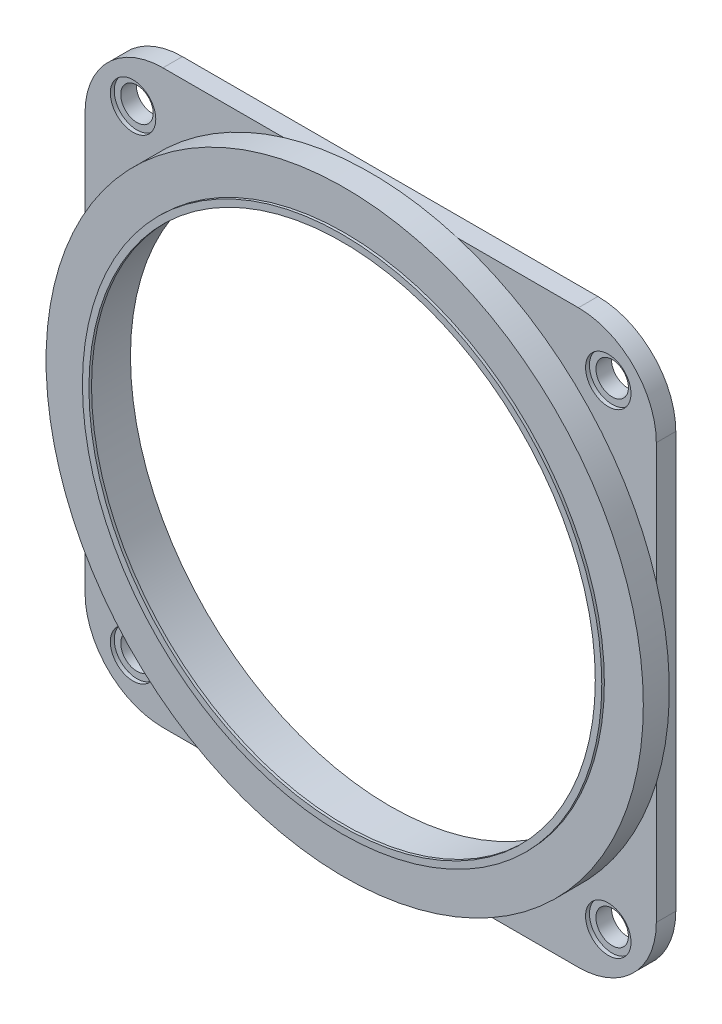
ISO-10303-21;
HEADER;
FILE_DESCRIPTION(('STEP AP214'),'2;1');
FILE_NAME('part.step','',(''),(''),'','','');
FILE_SCHEMA(('AUTOMOTIVE_DESIGN { 1 0 10303 214 1 1 1 1 }'));
ENDSEC;
DATA;
#1=APPLICATION_CONTEXT('core data for automotive mechanical design processes');
#2=APPLICATION_PROTOCOL_DEFINITION('international standard','automotive_design',2000,#1);
#3=PRODUCT_CONTEXT('',#1,'mechanical');
#4=PRODUCT('Part','Part','',(#3));
#5=PRODUCT_RELATED_PRODUCT_CATEGORY('part','',(#4));
#6=PRODUCT_DEFINITION_FORMATION('','',#4);
#7=PRODUCT_DEFINITION_CONTEXT('part definition',#1,'design');
#8=PRODUCT_DEFINITION('design','',#6,#7);
#9=PRODUCT_DEFINITION_SHAPE('','',#8);
#10=(LENGTH_UNIT() NAMED_UNIT(*) SI_UNIT(.MILLI.,.METRE.));
#11=(NAMED_UNIT(*) PLANE_ANGLE_UNIT() SI_UNIT($,.RADIAN.));
#12=(NAMED_UNIT(*) SI_UNIT($,.STERADIAN.) SOLID_ANGLE_UNIT());
#13=UNCERTAINTY_MEASURE_WITH_UNIT(LENGTH_MEASURE(1.E-05),#10,'distance_accuracy_value','');
#14=(GEOMETRIC_REPRESENTATION_CONTEXT(3) GLOBAL_UNCERTAINTY_ASSIGNED_CONTEXT((#13)) GLOBAL_UNIT_ASSIGNED_CONTEXT((#10,
#11,#12)) REPRESENTATION_CONTEXT('',''));
#15=CARTESIAN_POINT('',(0.,0.,0.));
#16=DIRECTION('',(0.,0.,1.));
#17=DIRECTION('',(1.,0.,0.));
#18=AXIS2_PLACEMENT_3D('',#15,#16,#17);
#19=CARTESIAN_POINT('',(0.,0.,3.7));
#20=DIRECTION('',(0.,0.,1.));
#21=DIRECTION('',(1.,0.,0.));
#22=AXIS2_PLACEMENT_3D('',#19,#20,#21);
#23=PLANE('',#22);
#24=CARTESIAN_POINT('',(0.,0.,3.7));
#25=DIRECTION('',(0.,0.,1.));
#26=DIRECTION('',(1.,0.,0.));
#27=AXIS2_PLACEMENT_3D('',#24,#25,#26);
#28=CIRCLE('',#27,20.);
#29=CARTESIAN_POINT('',(20.,0.,3.7));
#30=VERTEX_POINT('',#29);
#31=EDGE_CURVE('E11',#30,#30,#28,.T.);
#32=ORIENTED_EDGE('',*,*,#31,.T.);
#33=EDGE_LOOP('',(#32));
#34=FACE_BOUND('',#33,.T.);
#35=CARTESIAN_POINT('',(0.,0.,3.7));
#36=DIRECTION('',(0.,0.,1.));
#37=DIRECTION('',(1.,0.,0.));
#38=AXIS2_PLACEMENT_3D('',#35,#36,#37);
#39=CIRCLE('',#38,19.5);
#40=CARTESIAN_POINT('',(19.5,0.,3.7));
#41=VERTEX_POINT('',#40);
#42=EDGE_CURVE('E51',#41,#41,#39,.T.);
#43=ORIENTED_EDGE('',*,*,#42,.F.);
#44=EDGE_LOOP('',(#43));
#45=FACE_BOUND('',#44,.T.);
#46=ADVANCED_FACE('F40',(#34,#45),#23,.T.);
#47=CARTESIAN_POINT('',(0.,0.,3.5));
#48=DIRECTION('',(0.,0.,1.));
#49=DIRECTION('',(1.,0.,0.));
#50=AXIS2_PLACEMENT_3D('',#47,#48,#49);
#51=PLANE('',#50);
#52=CARTESIAN_POINT('',(0.,0.,3.5));
#53=DIRECTION('',(0.,0.,1.));
#54=DIRECTION('',(1.,0.,0.));
#55=AXIS2_PLACEMENT_3D('',#52,#53,#54);
#56=CIRCLE('',#55,20.);
#57=CARTESIAN_POINT('',(20.,0.,3.5));
#58=VERTEX_POINT('',#57);
#59=EDGE_CURVE('E44',#58,#58,#56,.T.);
#60=ORIENTED_EDGE('',*,*,#59,.F.);
#61=EDGE_LOOP('',(#60));
#62=FACE_BOUND('',#61,.T.);
#63=CARTESIAN_POINT('',(0.,0.,3.5));
#64=DIRECTION('',(0.,0.,1.));
#65=DIRECTION('',(1.,0.,0.));
#66=AXIS2_PLACEMENT_3D('',#63,#64,#65);
#67=CIRCLE('',#66,19.5);
#68=CARTESIAN_POINT('',(19.5,0.,3.5));
#69=VERTEX_POINT('',#68);
#70=EDGE_CURVE('E53',#69,#69,#67,.T.);
#71=ORIENTED_EDGE('',*,*,#70,.T.);
#72=EDGE_LOOP('',(#71));
#73=FACE_BOUND('',#72,.T.);
#74=ADVANCED_FACE('F63',(#62,#73),#51,.F.);
#75=CARTESIAN_POINT('',(0.,0.,3.7));
#76=DIRECTION('',(0.,0.,-1.));
#77=DIRECTION('',(-1.,0.,0.));
#78=AXIS2_PLACEMENT_3D('',#75,#76,#77);
#79=CYLINDRICAL_SURFACE('',#78,20.);
#80=ORIENTED_EDGE('',*,*,#31,.F.);
#81=EDGE_LOOP('',(#80));
#82=FACE_BOUND('',#81,.T.);
#83=ORIENTED_EDGE('',*,*,#59,.T.);
#84=EDGE_LOOP('',(#83));
#85=FACE_BOUND('',#84,.T.);
#86=ADVANCED_FACE('F42',(#82,#85),#79,.T.);
#87=CARTESIAN_POINT('',(0.,0.,3.7));
#88=DIRECTION('',(0.,0.,-1.));
#89=DIRECTION('',(-1.,0.,0.));
#90=AXIS2_PLACEMENT_3D('',#87,#88,#89);
#91=CYLINDRICAL_SURFACE('',#90,19.5);
#92=ORIENTED_EDGE('',*,*,#42,.T.);
#93=EDGE_LOOP('',(#92));
#94=FACE_BOUND('',#93,.T.);
#95=ORIENTED_EDGE('',*,*,#70,.F.);
#96=EDGE_LOOP('',(#95));
#97=FACE_BOUND('',#96,.T.);
#98=ADVANCED_FACE('F59',(#94,#97),#91,.F.);
#99=CLOSED_SHELL('',(#46,#74,#86,#98));
#100=MANIFOLD_SOLID_BREP('B2',#99);
#101=CARTESIAN_POINT('',(18.3,-18.3,-0.5));
#102=DIRECTION('',(0.,0.,1.));
#103=DIRECTION('',(1.,0.,0.));
#104=AXIS2_PLACEMENT_3D('',#101,#102,#103);
#105=CYLINDRICAL_SURFACE('',#104,1.25);
#106=CARTESIAN_POINT('',(18.3,-18.3,0.));
#107=DIRECTION('',(0.,0.,1.));
#108=DIRECTION('',(1.,0.,0.));
#109=AXIS2_PLACEMENT_3D('',#106,#107,#108);
#110=CIRCLE('',#109,1.25);
#111=CARTESIAN_POINT('',(19.55,-18.3,0.));
#112=VERTEX_POINT('',#111);
#113=EDGE_CURVE('E291',#112,#112,#110,.T.);
#114=ORIENTED_EDGE('',*,*,#113,.F.);
#115=EDGE_LOOP('',(#114));
#116=FACE_BOUND('',#115,.T.);
#117=CARTESIAN_POINT('',(18.3,-18.3,1.2));
#118=DIRECTION('',(0.,0.,1.));
#119=DIRECTION('',(1.,0.,0.));
#120=AXIS2_PLACEMENT_3D('',#117,#118,#119);
#121=CIRCLE('',#120,1.25);
#122=CARTESIAN_POINT('',(19.55,-18.3,1.2));
#123=VERTEX_POINT('',#122);
#124=EDGE_CURVE('E105',#123,#123,#121,.F.);
#125=ORIENTED_EDGE('',*,*,#124,.F.);
#126=EDGE_LOOP('',(#125));
#127=FACE_BOUND('',#126,.T.);
#128=ADVANCED_FACE('F101',(#116,#127),#105,.F.);
#129=CARTESIAN_POINT('',(-18.3,-18.3,-0.5));
#130=DIRECTION('',(0.,0.,1.));
#131=DIRECTION('',(1.,0.,0.));
#132=AXIS2_PLACEMENT_3D('',#129,#130,#131);
#133=CYLINDRICAL_SURFACE('',#132,1.25);
#134=CARTESIAN_POINT('',(-18.3,-18.3,0.));
#135=DIRECTION('',(0.,0.,1.));
#136=DIRECTION('',(1.,0.,0.));
#137=AXIS2_PLACEMENT_3D('',#134,#135,#136);
#138=CIRCLE('',#137,1.25);
#139=CARTESIAN_POINT('',(-17.05,-18.3,0.));
#140=VERTEX_POINT('',#139);
#141=EDGE_CURVE('E294',#140,#140,#138,.T.);
#142=ORIENTED_EDGE('',*,*,#141,.F.);
#143=EDGE_LOOP('',(#142));
#144=FACE_BOUND('',#143,.T.);
#145=CARTESIAN_POINT('',(-18.3,-18.3,1.2));
#146=DIRECTION('',(0.,0.,1.));
#147=DIRECTION('',(1.,0.,0.));
#148=AXIS2_PLACEMENT_3D('',#145,#146,#147);
#149=CIRCLE('',#148,1.25);
#150=CARTESIAN_POINT('',(-17.05,-18.3,1.2));
#151=VERTEX_POINT('',#150);
#152=EDGE_CURVE('E305',#151,#151,#149,.F.);
#153=ORIENTED_EDGE('',*,*,#152,.F.);
#154=EDGE_LOOP('',(#153));
#155=FACE_BOUND('',#154,.T.);
#156=ADVANCED_FACE('F351',(#144,#155),#133,.F.);
#157=CARTESIAN_POINT('',(-18.3,18.3,-0.5));
#158=DIRECTION('',(0.,0.,1.));
#159=DIRECTION('',(1.,0.,0.));
#160=AXIS2_PLACEMENT_3D('',#157,#158,#159);
#161=CYLINDRICAL_SURFACE('',#160,1.25);
#162=CARTESIAN_POINT('',(-18.3,18.3,0.));
#163=DIRECTION('',(0.,0.,1.));
#164=DIRECTION('',(1.,0.,0.));
#165=AXIS2_PLACEMENT_3D('',#162,#163,#164);
#166=CIRCLE('',#165,1.25);
#167=CARTESIAN_POINT('',(-17.05,18.3,0.));
#168=VERTEX_POINT('',#167);
#169=EDGE_CURVE('E288',#168,#168,#166,.T.);
#170=ORIENTED_EDGE('',*,*,#169,.F.);
#171=EDGE_LOOP('',(#170));
#172=FACE_BOUND('',#171,.T.);
#173=CARTESIAN_POINT('',(-18.3,18.3,1.2));
#174=DIRECTION('',(0.,0.,1.));
#175=DIRECTION('',(1.,0.,0.));
#176=AXIS2_PLACEMENT_3D('',#173,#174,#175);
#177=CIRCLE('',#176,1.25);
#178=CARTESIAN_POINT('',(-17.05,18.3,1.2));
#179=VERTEX_POINT('',#178);
#180=EDGE_CURVE('E301',#179,#179,#177,.F.);
#181=ORIENTED_EDGE('',*,*,#180,.F.);
#182=EDGE_LOOP('',(#181));
#183=FACE_BOUND('',#182,.T.);
#184=ADVANCED_FACE('F357',(#172,#183),#161,.F.);
#185=CARTESIAN_POINT('',(18.3,18.3,-0.5));
#186=DIRECTION('',(0.,0.,1.));
#187=DIRECTION('',(1.,0.,0.));
#188=AXIS2_PLACEMENT_3D('',#185,#186,#187);
#189=CYLINDRICAL_SURFACE('',#188,1.25);
#190=CARTESIAN_POINT('',(18.3,18.3,0.));
#191=DIRECTION('',(0.,0.,1.));
#192=DIRECTION('',(1.,0.,0.));
#193=AXIS2_PLACEMENT_3D('',#190,#191,#192);
#194=CIRCLE('',#193,1.25);
#195=CARTESIAN_POINT('',(19.55,18.3,0.));
#196=VERTEX_POINT('',#195);
#197=EDGE_CURVE('E285',#196,#196,#194,.T.);
#198=ORIENTED_EDGE('',*,*,#197,.F.);
#199=EDGE_LOOP('',(#198));
#200=FACE_BOUND('',#199,.T.);
#201=CARTESIAN_POINT('',(18.3,18.3,1.2));
#202=DIRECTION('',(0.,0.,1.));
#203=DIRECTION('',(1.,0.,0.));
#204=AXIS2_PLACEMENT_3D('',#201,#202,#203);
#205=CIRCLE('',#204,1.25);
#206=CARTESIAN_POINT('',(19.55,18.3,1.2));
#207=VERTEX_POINT('',#206);
#208=EDGE_CURVE('E297',#207,#207,#205,.F.);
#209=ORIENTED_EDGE('',*,*,#208,.F.);
#210=EDGE_LOOP('',(#209));
#211=FACE_BOUND('',#210,.T.);
#212=ADVANCED_FACE('F365',(#200,#211),#189,.F.);
#213=CARTESIAN_POINT('',(-16.,-16.,1.5));
#214=DIRECTION('',(0.,0.,1.));
#215=DIRECTION('',(1.,0.,0.));
#216=AXIS2_PLACEMENT_3D('',#213,#214,#215);
#217=PLANE('',#216);
#218=CARTESIAN_POINT('',(18.3,18.3,1.5));
#219=DIRECTION('',(0.,0.,1.));
#220=DIRECTION('',(1.,0.,0.));
#221=AXIS2_PLACEMENT_3D('',#218,#219,#220);
#222=CIRCLE('',#221,1.75);
#223=CARTESIAN_POINT('',(20.05,18.3,1.5));
#224=VERTEX_POINT('',#223);
#225=EDGE_CURVE('E303',#224,#224,#222,.T.);
#226=ORIENTED_EDGE('',*,*,#225,.F.);
#227=EDGE_LOOP('',(#226));
#228=FACE_BOUND('',#227,.T.);
#229=CARTESIAN_POINT('',(0.,0.,1.5));
#230=DIRECTION('',(0.,0.,1.));
#231=DIRECTION('',(1.,0.,0.));
#232=AXIS2_PLACEMENT_3D('',#229,#230,#231);
#233=CIRCLE('',#232,23.);
#234=CARTESIAN_POINT('',(22.,6.70820393249936,1.5));
#235=VERTEX_POINT('',#234);
#236=CARTESIAN_POINT('',(6.70820393249935,22.,1.5));
#237=VERTEX_POINT('',#236);
#238=EDGE_CURVE('E221',#235,#237,#233,.T.);
#239=ORIENTED_EDGE('',*,*,#238,.F.);
#240=DIRECTION('',(0.,1.,0.));
#241=VECTOR('',#240,1.);
#242=CARTESIAN_POINT('',(22.,16.,1.5));
#243=LINE('',#242,#241);
#244=CARTESIAN_POINT('',(22.,16.,1.5));
#245=VERTEX_POINT('',#244);
#246=EDGE_CURVE('E207',#235,#245,#243,.T.);
#247=ORIENTED_EDGE('',*,*,#246,.T.);
#248=CARTESIAN_POINT('',(16.,16.,1.5));
#249=DIRECTION('',(0.,0.,1.));
#250=DIRECTION('',(-1.,0.,0.));
#251=AXIS2_PLACEMENT_3D('',#248,#249,#250);
#252=CIRCLE('',#251,6.);
#253=CARTESIAN_POINT('',(16.,22.,1.5));
#254=VERTEX_POINT('',#253);
#255=EDGE_CURVE('E204',#245,#254,#252,.T.);
#256=ORIENTED_EDGE('',*,*,#255,.T.);
#257=DIRECTION('',(-1.,0.,0.));
#258=VECTOR('',#257,1.);
#259=CARTESIAN_POINT('',(-16.,22.,1.5));
#260=LINE('',#259,#258);
#261=EDGE_CURVE('E461',#254,#237,#260,.T.);
#262=ORIENTED_EDGE('',*,*,#261,.T.);
#263=EDGE_LOOP('',(#239,#247,#256,#262));
#264=FACE_BOUND('',#263,.T.);
#265=ADVANCED_FACE('F368',(#228,#264),#217,.T.);
#266=CARTESIAN_POINT('',(-18.3,18.3,1.5));
#267=DIRECTION('',(0.,0.,1.));
#268=DIRECTION('',(1.,0.,0.));
#269=AXIS2_PLACEMENT_3D('',#266,#267,#268);
#270=CIRCLE('',#269,1.75);
#271=CARTESIAN_POINT('',(-16.55,18.3,1.5));
#272=VERTEX_POINT('',#271);
#273=EDGE_CURVE('E307',#272,#272,#270,.T.);
#274=ORIENTED_EDGE('',*,*,#273,.F.);
#275=EDGE_LOOP('',(#274));
#276=FACE_BOUND('',#275,.T.);
#277=CARTESIAN_POINT('',(-6.70820393249935,22.,1.5));
#278=VERTEX_POINT('',#277);
#279=CARTESIAN_POINT('',(-22.,6.70820393249938,1.5));
#280=VERTEX_POINT('',#279);
#281=EDGE_CURVE('E38',#278,#280,#233,.T.);
#282=ORIENTED_EDGE('',*,*,#281,.F.);
#283=CARTESIAN_POINT('',(-16.,22.,1.5));
#284=VERTEX_POINT('',#283);
#285=EDGE_CURVE('E452',#278,#284,#260,.T.);
#286=ORIENTED_EDGE('',*,*,#285,.T.);
#287=CARTESIAN_POINT('',(-16.,16.,1.5));
#288=DIRECTION('',(0.,0.,1.));
#289=DIRECTION('',(1.,0.,0.));
#290=AXIS2_PLACEMENT_3D('',#287,#288,#289);
#291=CIRCLE('',#290,6.);
#292=CARTESIAN_POINT('',(-22.,16.,1.5));
#293=VERTEX_POINT('',#292);
#294=EDGE_CURVE('E245',#284,#293,#291,.T.);
#295=ORIENTED_EDGE('',*,*,#294,.T.);
#296=DIRECTION('',(0.,-1.,0.));
#297=VECTOR('',#296,1.);
#298=CARTESIAN_POINT('',(-22.,16.,1.5));
#299=LINE('',#298,#297);
#300=EDGE_CURVE('E241',#293,#280,#299,.T.);
#301=ORIENTED_EDGE('',*,*,#300,.T.);
#302=EDGE_LOOP('',(#282,#286,#295,#301));
#303=FACE_BOUND('',#302,.T.);
#304=ADVANCED_FACE('F373',(#276,#303),#217,.T.);
#305=CARTESIAN_POINT('',(-18.3,-18.3,1.5));
#306=DIRECTION('',(0.,0.,1.));
#307=DIRECTION('',(1.,0.,0.));
#308=AXIS2_PLACEMENT_3D('',#305,#306,#307);
#309=CIRCLE('',#308,1.75);
#310=CARTESIAN_POINT('',(-16.55,-18.3,1.5));
#311=VERTEX_POINT('',#310);
#312=EDGE_CURVE('E314',#311,#311,#309,.T.);
#313=ORIENTED_EDGE('',*,*,#312,.F.);
#314=EDGE_LOOP('',(#313));
#315=FACE_BOUND('',#314,.T.);
#316=CARTESIAN_POINT('',(-22.,-6.70820393249939,1.5));
#317=VERTEX_POINT('',#316);
#318=CARTESIAN_POINT('',(-6.70820393249939,-22.,1.5));
#319=VERTEX_POINT('',#318);
#320=EDGE_CURVE('E110',#317,#319,#233,.T.);
#321=ORIENTED_EDGE('',*,*,#320,.F.);
#322=CARTESIAN_POINT('',(-22.,-15.9999999999999,1.5));
#323=VERTEX_POINT('',#322);
#324=EDGE_CURVE('E242',#317,#323,#299,.T.);
#325=ORIENTED_EDGE('',*,*,#324,.T.);
#326=CARTESIAN_POINT('',(-16.,-16.,1.5));
#327=DIRECTION('',(0.,0.,1.));
#328=DIRECTION('',(1.,0.,0.));
#329=AXIS2_PLACEMENT_3D('',#326,#327,#328);
#330=CIRCLE('',#329,6.);
#331=CARTESIAN_POINT('',(-15.9999999999999,-22.,1.5));
#332=VERTEX_POINT('',#331);
#333=EDGE_CURVE('E266',#323,#332,#330,.T.);
#334=ORIENTED_EDGE('',*,*,#333,.T.);
#335=DIRECTION('',(1.,0.,0.));
#336=VECTOR('',#335,1.);
#337=CARTESIAN_POINT('',(-15.9999999999999,-22.,1.5));
#338=LINE('',#337,#336);
#339=EDGE_CURVE('E466',#332,#319,#338,.T.);
#340=ORIENTED_EDGE('',*,*,#339,.T.);
#341=EDGE_LOOP('',(#321,#325,#334,#340));
#342=FACE_BOUND('',#341,.T.);
#343=ADVANCED_FACE('F426',(#315,#342),#217,.T.);
#344=CARTESIAN_POINT('',(-16.,-16.,1.5));
#345=DIRECTION('',(0.,0.,-1.));
#346=DIRECTION('',(-1.,0.,0.));
#347=AXIS2_PLACEMENT_3D('',#344,#345,#346);
#348=CYLINDRICAL_SURFACE('',#347,6.);
#349=CARTESIAN_POINT('',(-16.,-16.,0.));
#350=DIRECTION('',(0.,0.,1.));
#351=DIRECTION('',(1.,0.,0.));
#352=AXIS2_PLACEMENT_3D('',#349,#350,#351);
#353=CIRCLE('',#352,6.);
#354=CARTESIAN_POINT('',(-22.,-15.9999999999999,0.));
#355=VERTEX_POINT('',#354);
#356=CARTESIAN_POINT('',(-15.9999999999999,-22.,0.));
#357=VERTEX_POINT('',#356);
#358=EDGE_CURVE('E249',#355,#357,#353,.T.);
#359=ORIENTED_EDGE('',*,*,#358,.T.);
#360=DIRECTION('',(0.,0.,-1.));
#361=VECTOR('',#360,1.);
#362=CARTESIAN_POINT('',(-15.9999999999999,-22.,1.5));
#363=LINE('',#362,#361);
#364=EDGE_CURVE('E225',#332,#357,#363,.T.);
#365=ORIENTED_EDGE('',*,*,#364,.F.);
#366=ORIENTED_EDGE('',*,*,#333,.F.);
#367=DIRECTION('',(0.,0.,-1.));
#368=VECTOR('',#367,1.);
#369=CARTESIAN_POINT('',(-22.,-15.9999999999999,1.5));
#370=LINE('',#369,#368);
#371=EDGE_CURVE('E244',#323,#355,#370,.T.);
#372=ORIENTED_EDGE('',*,*,#371,.T.);
#373=EDGE_LOOP('',(#359,#365,#366,#372));
#374=FACE_BOUND('',#373,.T.);
#375=ADVANCED_FACE('F103',(#374),#348,.T.);
#376=CARTESIAN_POINT('',(-15.9999999999999,-22.,1.5));
#377=DIRECTION('',(0.,1.,0.));
#378=DIRECTION('',(0.,0.,1.));
#379=AXIS2_PLACEMENT_3D('',#376,#377,#378);
#380=PLANE('',#379);
#381=DIRECTION('',(1.,0.,0.));
#382=VECTOR('',#381,1.);
#383=CARTESIAN_POINT('',(-15.9999999999999,-22.,0.));
#384=LINE('',#383,#382);
#385=CARTESIAN_POINT('',(16.,-22.,0.));
#386=VERTEX_POINT('',#385);
#387=EDGE_CURVE('E252',#357,#386,#384,.T.);
#388=ORIENTED_EDGE('',*,*,#387,.T.);
#389=DIRECTION('',(0.,0.,-1.));
#390=VECTOR('',#389,1.);
#391=CARTESIAN_POINT('',(16.,-22.,1.5));
#392=LINE('',#391,#390);
#393=CARTESIAN_POINT('',(16.,-22.,1.5));
#394=VERTEX_POINT('',#393);
#395=EDGE_CURVE('E227',#394,#386,#392,.T.);
#396=ORIENTED_EDGE('',*,*,#395,.F.);
#397=CARTESIAN_POINT('',(6.70820393249939,-22.,1.5));
#398=VERTEX_POINT('',#397);
#399=EDGE_CURVE('E469',#398,#394,#338,.T.);
#400=ORIENTED_EDGE('',*,*,#399,.F.);
#401=EDGE_CURVE('E468',#319,#398,#338,.T.);
#402=ORIENTED_EDGE('',*,*,#401,.F.);
#403=ORIENTED_EDGE('',*,*,#339,.F.);
#404=ORIENTED_EDGE('',*,*,#364,.T.);
#405=EDGE_LOOP('',(#388,#396,#400,#402,#403,#404));
#406=FACE_BOUND('',#405,.T.);
#407=ADVANCED_FACE('F442',(#406),#380,.F.);
#408=CARTESIAN_POINT('',(16.,-16.,1.5));
#409=DIRECTION('',(0.,0.,-1.));
#410=DIRECTION('',(-1.,0.,0.));
#411=AXIS2_PLACEMENT_3D('',#408,#409,#410);
#412=CYLINDRICAL_SURFACE('',#411,6.);
#413=CARTESIAN_POINT('',(16.,-16.,0.));
#414=DIRECTION('',(0.,0.,1.));
#415=DIRECTION('',(1.,0.,0.));
#416=AXIS2_PLACEMENT_3D('',#413,#414,#415);
#417=CIRCLE('',#416,6.);
#418=CARTESIAN_POINT('',(22.,-15.9999999999999,0.));
#419=VERTEX_POINT('',#418);
#420=EDGE_CURVE('E254',#386,#419,#417,.T.);
#421=ORIENTED_EDGE('',*,*,#420,.T.);
#422=DIRECTION('',(0.,0.,-1.));
#423=VECTOR('',#422,1.);
#424=CARTESIAN_POINT('',(22.,-15.9999999999999,1.5));
#425=LINE('',#424,#423);
#426=CARTESIAN_POINT('',(22.,-15.9999999999999,1.5));
#427=VERTEX_POINT('',#426);
#428=EDGE_CURVE('E281',#427,#419,#425,.T.);
#429=ORIENTED_EDGE('',*,*,#428,.F.);
#430=CARTESIAN_POINT('',(16.,-16.,1.5));
#431=DIRECTION('',(0.,0.,1.));
#432=DIRECTION('',(1.,0.,0.));
#433=AXIS2_PLACEMENT_3D('',#430,#431,#432);
#434=CIRCLE('',#433,6.);
#435=EDGE_CURVE('E200',#394,#427,#434,.T.);
#436=ORIENTED_EDGE('',*,*,#435,.F.);
#437=ORIENTED_EDGE('',*,*,#395,.T.);
#438=EDGE_LOOP('',(#421,#429,#436,#437));
#439=FACE_BOUND('',#438,.T.);
#440=ADVANCED_FACE('F489',(#439),#412,.T.);
#441=CARTESIAN_POINT('',(22.,16.,1.5));
#442=DIRECTION('',(-1.,0.,0.));
#443=DIRECTION('',(0.,-1.,0.));
#444=AXIS2_PLACEMENT_3D('',#441,#442,#443);
#445=PLANE('',#444);
#446=DIRECTION('',(0.,1.,0.));
#447=VECTOR('',#446,1.);
#448=CARTESIAN_POINT('',(22.,16.,0.));
#449=LINE('',#448,#447);
#450=CARTESIAN_POINT('',(22.,16.,0.));
#451=VERTEX_POINT('',#450);
#452=EDGE_CURVE('E256',#419,#451,#449,.T.);
#453=ORIENTED_EDGE('',*,*,#452,.T.);
#454=DIRECTION('',(0.,0.,-1.));
#455=VECTOR('',#454,1.);
#456=CARTESIAN_POINT('',(22.,16.,1.5));
#457=LINE('',#456,#455);
#458=EDGE_CURVE('E278',#245,#451,#457,.T.);
#459=ORIENTED_EDGE('',*,*,#458,.F.);
#460=ORIENTED_EDGE('',*,*,#246,.F.);
#461=CARTESIAN_POINT('',(22.,-6.70820393249935,1.5));
#462=VERTEX_POINT('',#461);
#463=EDGE_CURVE('E205',#462,#235,#243,.T.);
#464=ORIENTED_EDGE('',*,*,#463,.F.);
#465=EDGE_CURVE('E193',#427,#462,#243,.T.);
#466=ORIENTED_EDGE('',*,*,#465,.F.);
#467=ORIENTED_EDGE('',*,*,#428,.T.);
#468=EDGE_LOOP('',(#453,#459,#460,#464,#466,#467));
#469=FACE_BOUND('',#468,.T.);
#470=ADVANCED_FACE('F211',(#469),#445,.F.);
#471=CARTESIAN_POINT('',(16.,16.,1.5));
#472=DIRECTION('',(0.,0.,-1.));
#473=DIRECTION('',(-1.,0.,0.));
#474=AXIS2_PLACEMENT_3D('',#471,#472,#473);
#475=CYLINDRICAL_SURFACE('',#474,6.);
#476=CARTESIAN_POINT('',(16.,16.,0.));
#477=DIRECTION('',(0.,0.,1.));
#478=DIRECTION('',(-1.,0.,0.));
#479=AXIS2_PLACEMENT_3D('',#476,#477,#478);
#480=CIRCLE('',#479,6.);
#481=CARTESIAN_POINT('',(16.,22.,0.));
#482=VERTEX_POINT('',#481);
#483=EDGE_CURVE('E258',#451,#482,#480,.T.);
#484=ORIENTED_EDGE('',*,*,#483,.T.);
#485=DIRECTION('',(0.,0.,-1.));
#486=VECTOR('',#485,1.);
#487=CARTESIAN_POINT('',(16.,22.,1.5));
#488=LINE('',#487,#486);
#489=EDGE_CURVE('E275',#254,#482,#488,.T.);
#490=ORIENTED_EDGE('',*,*,#489,.F.);
#491=ORIENTED_EDGE('',*,*,#255,.F.);
#492=ORIENTED_EDGE('',*,*,#458,.T.);
#493=EDGE_LOOP('',(#484,#490,#491,#492));
#494=FACE_BOUND('',#493,.T.);
#495=ADVANCED_FACE('F497',(#494),#475,.T.);
#496=CARTESIAN_POINT('',(-16.,22.,1.5));
#497=DIRECTION('',(0.,-1.,0.));
#498=DIRECTION('',(0.,0.,-1.));
#499=AXIS2_PLACEMENT_3D('',#496,#497,#498);
#500=PLANE('',#499);
#501=DIRECTION('',(-1.,0.,0.));
#502=VECTOR('',#501,1.);
#503=CARTESIAN_POINT('',(-16.,22.,0.));
#504=LINE('',#503,#502);
#505=CARTESIAN_POINT('',(-16.,22.,0.));
#506=VERTEX_POINT('',#505);
#507=EDGE_CURVE('E260',#482,#506,#504,.T.);
#508=ORIENTED_EDGE('',*,*,#507,.T.);
#509=DIRECTION('',(0.,0.,-1.));
#510=VECTOR('',#509,1.);
#511=CARTESIAN_POINT('',(-16.,22.,1.5));
#512=LINE('',#511,#510);
#513=EDGE_CURVE('E272',#284,#506,#512,.T.);
#514=ORIENTED_EDGE('',*,*,#513,.F.);
#515=ORIENTED_EDGE('',*,*,#285,.F.);
#516=EDGE_CURVE('E458',#237,#278,#260,.T.);
#517=ORIENTED_EDGE('',*,*,#516,.F.);
#518=ORIENTED_EDGE('',*,*,#261,.F.);
#519=ORIENTED_EDGE('',*,*,#489,.T.);
#520=EDGE_LOOP('',(#508,#514,#515,#517,#518,#519));
#521=FACE_BOUND('',#520,.T.);
#522=ADVANCED_FACE('F456',(#521),#500,.F.);
#523=CARTESIAN_POINT('',(-16.,16.,1.5));
#524=DIRECTION('',(0.,0.,-1.));
#525=DIRECTION('',(-1.,0.,0.));
#526=AXIS2_PLACEMENT_3D('',#523,#524,#525);
#527=CYLINDRICAL_SURFACE('',#526,6.);
#528=CARTESIAN_POINT('',(-16.,16.,0.));
#529=DIRECTION('',(0.,0.,1.));
#530=DIRECTION('',(1.,0.,0.));
#531=AXIS2_PLACEMENT_3D('',#528,#529,#530);
#532=CIRCLE('',#531,6.);
#533=CARTESIAN_POINT('',(-22.,16.,0.));
#534=VERTEX_POINT('',#533);
#535=EDGE_CURVE('E262',#506,#534,#532,.T.);
#536=ORIENTED_EDGE('',*,*,#535,.T.);
#537=DIRECTION('',(0.,0.,-1.));
#538=VECTOR('',#537,1.);
#539=CARTESIAN_POINT('',(-22.,16.,1.5));
#540=LINE('',#539,#538);
#541=EDGE_CURVE('E269',#293,#534,#540,.T.);
#542=ORIENTED_EDGE('',*,*,#541,.F.);
#543=ORIENTED_EDGE('',*,*,#294,.F.);
#544=ORIENTED_EDGE('',*,*,#513,.T.);
#545=EDGE_LOOP('',(#536,#542,#543,#544));
#546=FACE_BOUND('',#545,.T.);
#547=ADVANCED_FACE('F433',(#546),#527,.T.);
#548=CARTESIAN_POINT('',(-22.,16.,1.5));
#549=DIRECTION('',(1.,0.,0.));
#550=DIRECTION('',(0.,1.,0.));
#551=AXIS2_PLACEMENT_3D('',#548,#549,#550);
#552=PLANE('',#551);
#553=DIRECTION('',(0.,-1.,0.));
#554=VECTOR('',#553,1.);
#555=CARTESIAN_POINT('',(-22.,16.,0.));
#556=LINE('',#555,#554);
#557=EDGE_CURVE('E264',#534,#355,#556,.T.);
#558=ORIENTED_EDGE('',*,*,#557,.T.);
#559=ORIENTED_EDGE('',*,*,#371,.F.);
#560=ORIENTED_EDGE('',*,*,#324,.F.);
#561=EDGE_CURVE('E125',#280,#317,#299,.T.);
#562=ORIENTED_EDGE('',*,*,#561,.F.);
#563=ORIENTED_EDGE('',*,*,#300,.F.);
#564=ORIENTED_EDGE('',*,*,#541,.T.);
#565=EDGE_LOOP('',(#558,#559,#560,#562,#563,#564));
#566=FACE_BOUND('',#565,.T.);
#567=ADVANCED_FACE('F425',(#566),#552,.F.);
#568=CARTESIAN_POINT('',(18.3,-18.3,1.5));
#569=DIRECTION('',(0.,0.,1.));
#570=DIRECTION('',(1.,0.,0.));
#571=AXIS2_PLACEMENT_3D('',#568,#569,#570);
#572=CIRCLE('',#571,1.75);
#573=CARTESIAN_POINT('',(20.05,-18.3,1.5));
#574=VERTEX_POINT('',#573);
#575=EDGE_CURVE('E321',#574,#574,#572,.T.);
#576=ORIENTED_EDGE('',*,*,#575,.F.);
#577=EDGE_LOOP('',(#576));
#578=FACE_BOUND('',#577,.T.);
#579=EDGE_CURVE('E197',#398,#462,#233,.T.);
#580=ORIENTED_EDGE('',*,*,#579,.F.);
#581=ORIENTED_EDGE('',*,*,#399,.T.);
#582=ORIENTED_EDGE('',*,*,#435,.T.);
#583=ORIENTED_EDGE('',*,*,#465,.T.);
#584=EDGE_LOOP('',(#580,#581,#582,#583));
#585=FACE_BOUND('',#584,.T.);
#586=ADVANCED_FACE('F195',(#578,#585),#217,.T.);
#587=CARTESIAN_POINT('',(-16.,-16.,0.));
#588=DIRECTION('',(0.,0.,1.));
#589=DIRECTION('',(1.,0.,0.));
#590=AXIS2_PLACEMENT_3D('',#587,#588,#589);
#591=PLANE('',#590);
#592=ORIENTED_EDGE('',*,*,#141,.T.);
#593=EDGE_LOOP('',(#592));
#594=FACE_BOUND('',#593,.T.);
#595=ORIENTED_EDGE('',*,*,#113,.T.);
#596=EDGE_LOOP('',(#595));
#597=FACE_BOUND('',#596,.T.);
#598=ORIENTED_EDGE('',*,*,#169,.T.);
#599=EDGE_LOOP('',(#598));
#600=FACE_BOUND('',#599,.T.);
#601=ORIENTED_EDGE('',*,*,#197,.T.);
#602=EDGE_LOOP('',(#601));
#603=FACE_BOUND('',#602,.T.);
#604=CARTESIAN_POINT('',(0.,0.,0.));
#605=DIRECTION('',(0.,0.,1.));
#606=DIRECTION('',(1.,0.,0.));
#607=AXIS2_PLACEMENT_3D('',#604,#605,#606);
#608=CIRCLE('',#607,20.);
#609=CARTESIAN_POINT('',(20.,0.,0.));
#610=VERTEX_POINT('',#609);
#611=EDGE_CURVE('E234',#610,#610,#608,.T.);
#612=ORIENTED_EDGE('',*,*,#611,.T.);
#613=EDGE_LOOP('',(#612));
#614=FACE_BOUND('',#613,.T.);
#615=ORIENTED_EDGE('',*,*,#358,.F.);
#616=ORIENTED_EDGE('',*,*,#557,.F.);
#617=ORIENTED_EDGE('',*,*,#535,.F.);
#618=ORIENTED_EDGE('',*,*,#507,.F.);
#619=ORIENTED_EDGE('',*,*,#483,.F.);
#620=ORIENTED_EDGE('',*,*,#452,.F.);
#621=ORIENTED_EDGE('',*,*,#420,.F.);
#622=ORIENTED_EDGE('',*,*,#387,.F.);
#623=EDGE_LOOP('',(#615,#616,#617,#618,#619,#620,#621,#622));
#624=FACE_BOUND('',#623,.T.);
#625=ADVANCED_FACE('F424',(#594,#597,#600,#603,#614,#624),#591,.F.);
#626=CARTESIAN_POINT('',(0.,0.,0.));
#627=DIRECTION('',(0.,0.,1.));
#628=DIRECTION('',(1.,0.,0.));
#629=AXIS2_PLACEMENT_3D('',#626,#627,#628);
#630=CYLINDRICAL_SURFACE('',#629,20.);
#631=ORIENTED_EDGE('',*,*,#611,.F.);
#632=EDGE_LOOP('',(#631));
#633=FACE_BOUND('',#632,.T.);
#634=CARTESIAN_POINT('',(0.,0.,3.5));
#635=DIRECTION('',(0.,0.,1.));
#636=DIRECTION('',(1.,0.,0.));
#637=AXIS2_PLACEMENT_3D('',#634,#635,#636);
#638=CIRCLE('',#637,20.);
#639=CARTESIAN_POINT('',(20.,0.,3.5));
#640=VERTEX_POINT('',#639);
#641=EDGE_CURVE('E220',#640,#640,#638,.T.);
#642=ORIENTED_EDGE('',*,*,#641,.T.);
#643=EDGE_LOOP('',(#642));
#644=FACE_BOUND('',#643,.T.);
#645=ADVANCED_FACE('F333',(#633,#644),#630,.F.);
#646=CARTESIAN_POINT('',(0.,0.,1.5));
#647=DIRECTION('',(0.,0.,1.));
#648=DIRECTION('',(1.,0.,0.));
#649=AXIS2_PLACEMENT_3D('',#646,#647,#648);
#650=PLANE('',#649);
#651=EDGE_CURVE('E219',#319,#398,#233,.T.);
#652=ORIENTED_EDGE('',*,*,#651,.F.);
#653=ORIENTED_EDGE('',*,*,#401,.T.);
#654=EDGE_LOOP('',(#652,#653));
#655=FACE_BOUND('',#654,.T.);
#656=ADVANCED_FACE('F348',(#655),#650,.F.);
#657=EDGE_CURVE('E215',#462,#235,#233,.T.);
#658=ORIENTED_EDGE('',*,*,#657,.F.);
#659=ORIENTED_EDGE('',*,*,#463,.T.);
#660=EDGE_LOOP('',(#658,#659));
#661=FACE_BOUND('',#660,.T.);
#662=ADVANCED_FACE('F216',(#661),#650,.F.);
#663=EDGE_CURVE('E112',#237,#278,#233,.T.);
#664=ORIENTED_EDGE('',*,*,#663,.F.);
#665=ORIENTED_EDGE('',*,*,#516,.T.);
#666=EDGE_LOOP('',(#664,#665));
#667=FACE_BOUND('',#666,.T.);
#668=ADVANCED_FACE('F346',(#667),#650,.F.);
#669=EDGE_CURVE('E235',#280,#317,#233,.T.);
#670=ORIENTED_EDGE('',*,*,#669,.F.);
#671=ORIENTED_EDGE('',*,*,#561,.T.);
#672=EDGE_LOOP('',(#670,#671));
#673=FACE_BOUND('',#672,.T.);
#674=ADVANCED_FACE('F240',(#673),#650,.F.);
#675=CARTESIAN_POINT('',(0.,0.,3.5));
#676=DIRECTION('',(0.,0.,1.));
#677=DIRECTION('',(1.,0.,0.));
#678=AXIS2_PLACEMENT_3D('',#675,#676,#677);
#679=PLANE('',#678);
#680=CARTESIAN_POINT('',(0.,0.,3.5));
#681=DIRECTION('',(0.,0.,1.));
#682=DIRECTION('',(1.,0.,0.));
#683=AXIS2_PLACEMENT_3D('',#680,#681,#682);
#684=CIRCLE('',#683,23.);
#685=CARTESIAN_POINT('',(23.,0.,3.5));
#686=VERTEX_POINT('',#685);
#687=EDGE_CURVE('E231',#686,#686,#684,.T.);
#688=ORIENTED_EDGE('',*,*,#687,.T.);
#689=EDGE_LOOP('',(#688));
#690=FACE_BOUND('',#689,.T.);
#691=ORIENTED_EDGE('',*,*,#641,.F.);
#692=EDGE_LOOP('',(#691));
#693=FACE_BOUND('',#692,.T.);
#694=ADVANCED_FACE('F335',(#690,#693),#679,.T.);
#695=CARTESIAN_POINT('',(0.,0.,3.5));
#696=DIRECTION('',(0.,0.,-1.));
#697=DIRECTION('',(-1.,0.,0.));
#698=AXIS2_PLACEMENT_3D('',#695,#696,#697);
#699=CYLINDRICAL_SURFACE('',#698,23.);
#700=ORIENTED_EDGE('',*,*,#687,.F.);
#701=EDGE_LOOP('',(#700));
#702=FACE_BOUND('',#701,.T.);
#703=ORIENTED_EDGE('',*,*,#238,.T.);
#704=ORIENTED_EDGE('',*,*,#663,.T.);
#705=ORIENTED_EDGE('',*,*,#281,.T.);
#706=ORIENTED_EDGE('',*,*,#669,.T.);
#707=ORIENTED_EDGE('',*,*,#320,.T.);
#708=ORIENTED_EDGE('',*,*,#651,.T.);
#709=ORIENTED_EDGE('',*,*,#579,.T.);
#710=ORIENTED_EDGE('',*,*,#657,.T.);
#711=EDGE_LOOP('',(#703,#704,#705,#706,#707,#708,#709,#710));
#712=FACE_BOUND('',#711,.T.);
#713=ADVANCED_FACE('F223',(#702,#712),#699,.T.);
#714=CARTESIAN_POINT('',(18.3,18.3,1.2));
#715=DIRECTION('',(0.,0.,1.));
#716=DIRECTION('',(1.,0.,0.));
#717=AXIS2_PLACEMENT_3D('',#714,#715,#716);
#718=PLANE('',#717);
#719=CARTESIAN_POINT('',(18.3,18.3,1.2));
#720=DIRECTION('',(0.,0.,1.));
#721=DIRECTION('',(1.,0.,0.));
#722=AXIS2_PLACEMENT_3D('',#719,#720,#721);
#723=CIRCLE('',#722,1.75);
#724=CARTESIAN_POINT('',(20.05,18.3,1.2));
#725=VERTEX_POINT('',#724);
#726=EDGE_CURVE('E300',#725,#725,#723,.T.);
#727=ORIENTED_EDGE('',*,*,#726,.T.);
#728=EDGE_LOOP('',(#727));
#729=FACE_BOUND('',#728,.T.);
#730=ORIENTED_EDGE('',*,*,#208,.T.);
#731=EDGE_LOOP('',(#730));
#732=FACE_BOUND('',#731,.T.);
#733=ADVANCED_FACE('F343',(#729,#732),#718,.T.);
#734=CARTESIAN_POINT('',(18.3,18.3,1.2));
#735=DIRECTION('',(0.,0.,1.));
#736=DIRECTION('',(1.,0.,0.));
#737=AXIS2_PLACEMENT_3D('',#734,#735,#736);
#738=CYLINDRICAL_SURFACE('',#737,1.75);
#739=ORIENTED_EDGE('',*,*,#726,.F.);
#740=EDGE_LOOP('',(#739));
#741=FACE_BOUND('',#740,.T.);
#742=ORIENTED_EDGE('',*,*,#225,.T.);
#743=EDGE_LOOP('',(#742));
#744=FACE_BOUND('',#743,.T.);
#745=ADVANCED_FACE('F381',(#741,#744),#738,.F.);
#746=CARTESIAN_POINT('',(-18.3,18.3,1.2));
#747=DIRECTION('',(0.,0.,1.));
#748=DIRECTION('',(1.,0.,0.));
#749=AXIS2_PLACEMENT_3D('',#746,#747,#748);
#750=PLANE('',#749);
#751=CARTESIAN_POINT('',(-18.3,18.3,1.2));
#752=DIRECTION('',(0.,0.,1.));
#753=DIRECTION('',(1.,0.,0.));
#754=AXIS2_PLACEMENT_3D('',#751,#752,#753);
#755=CIRCLE('',#754,1.75);
#756=CARTESIAN_POINT('',(-16.55,18.3,1.2));
#757=VERTEX_POINT('',#756);
#758=EDGE_CURVE('E304',#757,#757,#755,.T.);
#759=ORIENTED_EDGE('',*,*,#758,.T.);
#760=EDGE_LOOP('',(#759));
#761=FACE_BOUND('',#760,.T.);
#762=ORIENTED_EDGE('',*,*,#180,.T.);
#763=EDGE_LOOP('',(#762));
#764=FACE_BOUND('',#763,.T.);
#765=ADVANCED_FACE('F387',(#761,#764),#750,.T.);
#766=CARTESIAN_POINT('',(-18.3,18.3,1.2));
#767=DIRECTION('',(0.,0.,1.));
#768=DIRECTION('',(1.,0.,0.));
#769=AXIS2_PLACEMENT_3D('',#766,#767,#768);
#770=CYLINDRICAL_SURFACE('',#769,1.75);
#771=ORIENTED_EDGE('',*,*,#758,.F.);
#772=EDGE_LOOP('',(#771));
#773=FACE_BOUND('',#772,.T.);
#774=ORIENTED_EDGE('',*,*,#273,.T.);
#775=EDGE_LOOP('',(#774));
#776=FACE_BOUND('',#775,.T.);
#777=ADVANCED_FACE('F390',(#773,#776),#770,.F.);
#778=CARTESIAN_POINT('',(-18.3,-18.3,1.2));
#779=DIRECTION('',(0.,0.,1.));
#780=DIRECTION('',(1.,0.,0.));
#781=AXIS2_PLACEMENT_3D('',#778,#779,#780);
#782=PLANE('',#781);
#783=CARTESIAN_POINT('',(-18.3,-18.3,1.2));
#784=DIRECTION('',(0.,0.,1.));
#785=DIRECTION('',(1.,0.,0.));
#786=AXIS2_PLACEMENT_3D('',#783,#784,#785);
#787=CIRCLE('',#786,1.75);
#788=CARTESIAN_POINT('',(-16.55,-18.3,1.2));
#789=VERTEX_POINT('',#788);
#790=EDGE_CURVE('E308',#789,#789,#787,.T.);
#791=ORIENTED_EDGE('',*,*,#790,.T.);
#792=EDGE_LOOP('',(#791));
#793=FACE_BOUND('',#792,.T.);
#794=ORIENTED_EDGE('',*,*,#152,.T.);
#795=EDGE_LOOP('',(#794));
#796=FACE_BOUND('',#795,.T.);
#797=ADVANCED_FACE('F393',(#793,#796),#782,.T.);
#798=CARTESIAN_POINT('',(-18.3,-18.3,1.2));
#799=DIRECTION('',(0.,0.,1.));
#800=DIRECTION('',(1.,0.,0.));
#801=AXIS2_PLACEMENT_3D('',#798,#799,#800);
#802=CYLINDRICAL_SURFACE('',#801,1.75);
#803=ORIENTED_EDGE('',*,*,#790,.F.);
#804=EDGE_LOOP('',(#803));
#805=FACE_BOUND('',#804,.T.);
#806=ORIENTED_EDGE('',*,*,#312,.T.);
#807=EDGE_LOOP('',(#806));
#808=FACE_BOUND('',#807,.T.);
#809=ADVANCED_FACE('F398',(#805,#808),#802,.F.);
#810=CARTESIAN_POINT('',(18.3,-18.3,1.2));
#811=DIRECTION('',(0.,0.,1.));
#812=DIRECTION('',(1.,0.,0.));
#813=AXIS2_PLACEMENT_3D('',#810,#811,#812);
#814=PLANE('',#813);
#815=CARTESIAN_POINT('',(18.3,-18.3,1.2));
#816=DIRECTION('',(0.,0.,1.));
#817=DIRECTION('',(1.,0.,0.));
#818=AXIS2_PLACEMENT_3D('',#815,#816,#817);
#819=CIRCLE('',#818,1.75);
#820=CARTESIAN_POINT('',(20.05,-18.3,1.2));
#821=VERTEX_POINT('',#820);
#822=EDGE_CURVE('E416',#821,#821,#819,.T.);
#823=ORIENTED_EDGE('',*,*,#822,.T.);
#824=EDGE_LOOP('',(#823));
#825=FACE_BOUND('',#824,.T.);
#826=ORIENTED_EDGE('',*,*,#124,.T.);
#827=EDGE_LOOP('',(#826));
#828=FACE_BOUND('',#827,.T.);
#829=ADVANCED_FACE('F401',(#825,#828),#814,.T.);
#830=CARTESIAN_POINT('',(18.3,-18.3,1.2));
#831=DIRECTION('',(0.,0.,1.));
#832=DIRECTION('',(1.,0.,0.));
#833=AXIS2_PLACEMENT_3D('',#830,#831,#832);
#834=CYLINDRICAL_SURFACE('',#833,1.75);
#835=ORIENTED_EDGE('',*,*,#822,.F.);
#836=EDGE_LOOP('',(#835));
#837=FACE_BOUND('',#836,.T.);
#838=ORIENTED_EDGE('',*,*,#575,.T.);
#839=EDGE_LOOP('',(#838));
#840=FACE_BOUND('',#839,.T.);
#841=ADVANCED_FACE('F405',(#837,#840),#834,.F.);
#842=CLOSED_SHELL('',(#128,#156,#184,#212,#265,#304,#343,#375,#407,#440,#470,#495,#522,#547,
#567,#586,#625,#645,#656,#662,#668,#674,#694,#713,#733,#745,#765,#777,#797,#809,#829,#841));
#843=MANIFOLD_SOLID_BREP('B6',#842);
#844=ADVANCED_BREP_SHAPE_REPRESENTATION('',(#18,#100,#843),#14);
#845=SHAPE_DEFINITION_REPRESENTATION(#9,#844);
ENDSEC;
END-ISO-10303-21;
